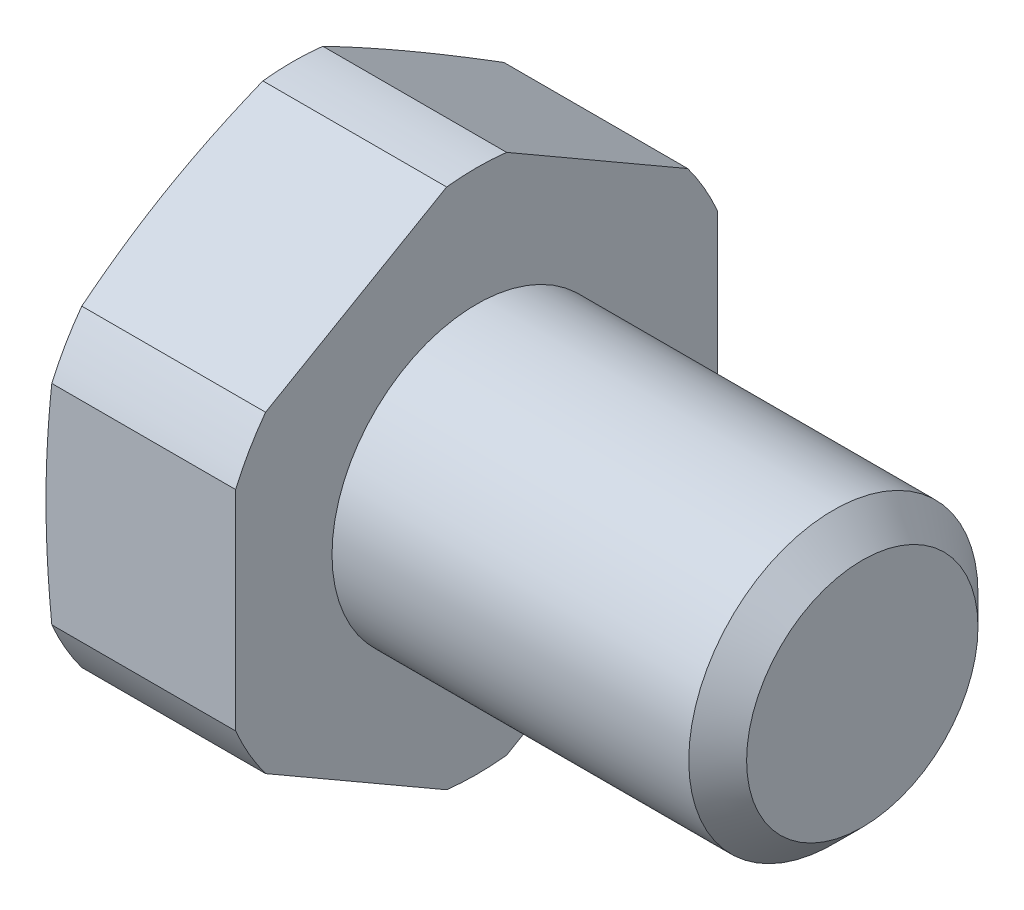
ISO-10303-21;
HEADER;
FILE_DESCRIPTION(('STEP AP214'),'2;1');
FILE_NAME('part.step','',(''),(''),'','','');
FILE_SCHEMA(('AUTOMOTIVE_DESIGN { 1 0 10303 214 1 1 1 1 }'));
ENDSEC;
DATA;
#1=APPLICATION_CONTEXT('core data for automotive mechanical design processes');
#2=APPLICATION_PROTOCOL_DEFINITION('international standard','automotive_design',2000,#1);
#3=PRODUCT_CONTEXT('',#1,'mechanical');
#4=PRODUCT('Part','Part','',(#3));
#5=PRODUCT_RELATED_PRODUCT_CATEGORY('part','',(#4));
#6=PRODUCT_DEFINITION_FORMATION('','',#4);
#7=PRODUCT_DEFINITION_CONTEXT('part definition',#1,'design');
#8=PRODUCT_DEFINITION('design','',#6,#7);
#9=PRODUCT_DEFINITION_SHAPE('','',#8);
#10=(LENGTH_UNIT() NAMED_UNIT(*) SI_UNIT(.MILLI.,.METRE.));
#11=(NAMED_UNIT(*) PLANE_ANGLE_UNIT() SI_UNIT($,.RADIAN.));
#12=(NAMED_UNIT(*) SI_UNIT($,.STERADIAN.) SOLID_ANGLE_UNIT());
#13=UNCERTAINTY_MEASURE_WITH_UNIT(LENGTH_MEASURE(1.E-05),#10,'distance_accuracy_value','');
#14=(GEOMETRIC_REPRESENTATION_CONTEXT(3) GLOBAL_UNCERTAINTY_ASSIGNED_CONTEXT((#13)) GLOBAL_UNIT_ASSIGNED_CONTEXT((#10,
#11,#12)) REPRESENTATION_CONTEXT('',''));
#15=CARTESIAN_POINT('',(0.,0.,0.));
#16=DIRECTION('',(0.,0.,1.));
#17=DIRECTION('',(1.,0.,0.));
#18=AXIS2_PLACEMENT_3D('',#15,#16,#17);
#19=CARTESIAN_POINT('',(-3.8124355652982,0.,0.));
#20=DIRECTION('',(1.,0.,0.));
#21=DIRECTION('',(0.,0.,-1.));
#22=AXIS2_PLACEMENT_3D('',#19,#20,#21);
#23=CONICAL_SURFACE('',#22,5.45,1.30899693899572);
#24=CARTESIAN_POINT('',(-4.,0.,0.));
#25=DIRECTION('',(-1.,0.,0.));
#26=DIRECTION('',(0.,0.,1.));
#27=AXIS2_PLACEMENT_3D('',#24,#25,#26);
#28=CIRCLE('',#27,4.75);
#29=CARTESIAN_POINT('',(-4.,0.,4.75));
#30=VERTEX_POINT('',#29);
#31=EDGE_CURVE('E136',#30,#30,#28,.T.);
#32=ORIENTED_EDGE('',*,*,#31,.F.);
#33=EDGE_LOOP('',(#32));
#34=FACE_BOUND('',#33,.T.);
#35=CARTESIAN_POINT('',(-3.8122355652982,3.24492698806514,-4.37962158981973));
#36=CARTESIAN_POINT('',(-3.8315035909995,3.33515905805744,-4.22333506012097));
#37=CARTESIAN_POINT('',(-3.84874992340172,3.42550504054802,-4.06685122818755));
#38=CARTESIAN_POINT('',(-3.87876035394968,3.60639535151776,-3.75354001899102));
#39=CARTESIAN_POINT('',(-3.89152379526239,3.69693970710853,-3.59671259476924));
#40=CARTESIAN_POINT('',(-3.91209179943862,3.87789023602862,-3.28329708502316));
#41=CARTESIAN_POINT('',(-3.91991159522667,3.96829596905989,-3.1267097621175));
#42=CARTESIAN_POINT('',(-3.93037186796461,4.14917681117599,-2.81341495345658));
#43=CARTESIAN_POINT('',(-3.93301270189222,4.2396519150491,-2.65670747672828));
#44=CARTESIAN_POINT('',(-3.93301270189222,4.42060212279532,-2.34329252327168));
#45=CARTESIAN_POINT('',(-3.93037186796461,4.51107722666843,-2.18658504654338));
#46=CARTESIAN_POINT('',(-3.91991159522667,4.69195806878452,-1.87329023788246));
#47=CARTESIAN_POINT('',(-3.91209179943862,4.78236380181579,-1.71670291497679));
#48=CARTESIAN_POINT('',(-3.89152379526239,4.96331433073589,-1.40328740523072));
#49=CARTESIAN_POINT('',(-3.87876035394968,5.05385868632665,-1.24645998100894));
#50=CARTESIAN_POINT('',(-3.84874992340171,5.2347489972964,-0.933148771812404));
#51=CARTESIAN_POINT('',(-3.83150359099949,5.32509497978698,-0.77666493987899));
#52=CARTESIAN_POINT('',(-3.81223556529819,5.41532704977928,-0.620378410180224));
#53=B_SPLINE_CURVE_WITH_KNOTS('',3,(#35,#36,#37,#38,#39,#40,#41,#42,#43,#44,#45,#46,#47,#48,#49,
#50,#51,#52),.UNSPECIFIED.,.F.,.F.,(4,2,2,2,2,2,2,2,4),(0.,0.54447599676277,1.08903173688009,
1.63190124482929,2.17473333231911,2.71756541980894,3.26043492775814,3.80499066787546,
4.34946666463823),.UNSPECIFIED.);
#54=CARTESIAN_POINT('',(-3.8124355652982,3.24586459681213,-4.37799760383233));
#55=VERTEX_POINT('',#54);
#56=CARTESIAN_POINT('',(-3.8124355652982,5.41438944103226,-0.622002396167665));
#57=VERTEX_POINT('',#56);
#58=EDGE_CURVE('E208',#55,#57,#53,.T.);
#59=ORIENTED_EDGE('',*,*,#58,.F.);
#60=CARTESIAN_POINT('',(-3.8124355652982,0.,0.));
#61=DIRECTION('',(-1.,0.,0.));
#62=DIRECTION('',(0.,0.,1.));
#63=AXIS2_PLACEMENT_3D('',#60,#61,#62);
#64=CIRCLE('',#63,5.45);
#65=CARTESIAN_POINT('',(-3.8124355652982,2.16852484422014,-5.));
#66=VERTEX_POINT('',#65);
#67=EDGE_CURVE('E291',#55,#66,#64,.T.);
#68=ORIENTED_EDGE('',*,*,#67,.T.);
#69=CARTESIAN_POINT('',(-2.830435154416,-7.62108614568718,-5.));
#70=CARTESIAN_POINT('',(-2.88120209797258,-7.39442371211339,-5.));
#71=CARTESIAN_POINT('',(-2.93134556516227,-7.16761907889241,-5.));
#72=CARTESIAN_POINT('',(-3.03004902948035,-6.71365560990672,-5.));
#73=CARTESIAN_POINT('',(-3.07860895773894,-6.4864967591857,-5.));
#74=CARTESIAN_POINT('',(-3.17385150931226,-6.0315495025437,-5.));
#75=CARTESIAN_POINT('',(-3.22053222527809,-5.80376069589011,-5.));
#76=CARTESIAN_POINT('',(-3.31151001956537,-5.34770783172051,-5.));
#77=CARTESIAN_POINT('',(-3.3558071181691,-5.11944377826557,-5.));
#78=CARTESIAN_POINT('',(-3.4411075281363,-4.66418646959809,-5.));
#79=CARTESIAN_POINT('',(-3.48213433474762,-4.43719763845752,-5.));
#80=CARTESIAN_POINT('',(-3.5605891401129,-3.98259997066756,-5.));
#81=CARTESIAN_POINT('',(-3.59801721846509,-3.75499114784598,-5.));
#82=CARTESIAN_POINT('',(-3.66842860196543,-3.29911107812409,-5.));
#83=CARTESIAN_POINT('',(-3.70141247969032,-3.07083992043547,-5.));
#84=CARTESIAN_POINT('',(-3.76196068204273,-2.6135717262178,-5.));
#85=CARTESIAN_POINT('',(-3.78952500224215,-2.38457468909583,-5.));
#86=CARTESIAN_POINT('',(-3.83845030974012,-1.92327707694903,-5.));
#87=CARTESIAN_POINT('',(-3.85973725345162,-1.69096853031645,-5.));
#88=CARTESIAN_POINT('',(-3.89463720444701,-1.22577076482486,-5.));
#89=CARTESIAN_POINT('',(-3.90825038771012,-0.992881559404886,-5.));
#90=CARTESIAN_POINT('',(-3.92700868255058,-0.526860013398153,-5.));
#91=CARTESIAN_POINT('',(-3.93215759017723,-0.293727828749546,-5.));
#92=CARTESIAN_POINT('',(-3.93367114199559,0.172565509188208,-5.));
#93=CARTESIAN_POINT('',(-3.93003579094568,0.405726662461594,-5.));
#94=CARTESIAN_POINT('',(-3.91418522340838,0.872602182612577,-5.));
#95=CARTESIAN_POINT('',(-3.9019387776737,1.10631546764105,-5.));
#96=CARTESIAN_POINT('',(-3.8695634215591,1.57319035782345,-5.));
#97=CARTESIAN_POINT('',(-3.84943433779392,1.80635195072895,-5.));
#98=CARTESIAN_POINT('',(-3.80230675741258,2.27212210256566,-5.));
#99=CARTESIAN_POINT('',(-3.77530380767398,2.50473020395076,-5.));
#100=CARTESIAN_POINT('',(-3.71554697344907,2.96919829473803,-5.));
#101=CARTESIAN_POINT('',(-3.68279307135858,3.20105828184795,-5.));
#102=CARTESIAN_POINT('',(-3.61492582370549,3.64858107787179,-5.));
#103=CARTESIAN_POINT('',(-3.58011659874086,3.86429046615707,-5.));
#104=CARTESIAN_POINT('',(-3.50712924185992,4.29514088007846,-5.));
#105=CARTESIAN_POINT('',(-3.46895101875147,4.51028189016726,-5.));
#106=CARTESIAN_POINT('',(-3.35031434414398,5.15498464345157,-5.));
#107=CARTESIAN_POINT('',(-3.26575944676272,5.58379089346186,-5.));
#108=CARTESIAN_POINT('',(-3.08936194162874,6.43998322963982,-5.));
#109=CARTESIAN_POINT('',(-2.99751759102386,6.86736895056687,-5.));
#110=CARTESIAN_POINT('',(-2.80885188867207,7.72100969351695,-5.));
#111=CARTESIAN_POINT('',(-2.71203082575452,8.14726477965121,-5.));
#112=CARTESIAN_POINT('',(-2.51586740601024,8.9947544783887,-5.));
#113=CARTESIAN_POINT('',(-2.41655941078843,9.41599708456601,-5.));
#114=CARTESIAN_POINT('',(-2.21545799548836,10.2578953303561,-5.));
#115=CARTESIAN_POINT('',(-2.11366453046326,10.6785509592085,-5.));
#116=CARTESIAN_POINT('',(-1.90836724186912,11.5188975285423,-5.));
#117=CARTESIAN_POINT('',(-1.80486566651573,11.9385890195114,-5.));
#118=CARTESIAN_POINT('',(-1.59644919766966,12.7776065494314,-5.));
#119=CARTESIAN_POINT('',(-1.49153435068999,13.1969325999283,-5.));
#120=CARTESIAN_POINT('',(-1.38611863930613,13.6161312291119,-5.));
#121=B_SPLINE_CURVE_WITH_KNOTS('',3,(#69,#70,#71,#72,#73,#74,#75,#76,#77,#78,#79,#80,#81,#82,
#83,#84,#85,#86,#87,#88,#89,#90,#91,#92,#93,#94,#95,#96,#97,#98,#99,#100,#101,#102,#103,#104,
#105,#106,#107,#108,#109,#110,#111,#112,#113,#114,#115,#116,#117,#118,#119,#120),.UNSPECIFIED.,
.F.,.F.,(4,2,2,2,2,2,2,2,2,2,2,2,2,2,2,2,2,2,2,2,2,2,2,2,2,4),(0.,0.696837321487225,
1.39370490886476,2.09126282716078,2.78881480897114,3.48079178070997,4.17275344348079,
4.86462587068375,5.5564988631845,6.25623321055747,6.95595151055346,7.65535591593532,
8.3547599424542,9.05671361858794,9.75868273565141,10.4611077745029,11.1635349635777,
11.8190031071993,12.4744889984981,13.785567701482,15.0969608231136,16.4082779222481,
17.7066391814984,19.0050239375285,20.3018179916293,21.5985694699626),.UNSPECIFIED.);
#122=CARTESIAN_POINT('',(-3.8124355652982,-2.16852484422014,-5.));
#123=VERTEX_POINT('',#122);
#124=EDGE_CURVE('E187',#123,#66,#121,.T.);
#125=ORIENTED_EDGE('',*,*,#124,.F.);
#126=CARTESIAN_POINT('',(-3.8124355652982,-3.24586459681212,-4.37799760383234));
#127=VERTEX_POINT('',#126);
#128=EDGE_CURVE('E186',#123,#127,#64,.T.);
#129=ORIENTED_EDGE('',*,*,#128,.T.);
#130=CARTESIAN_POINT('',(-3.81223556529819,-5.41532704977928,-0.620378410180221));
#131=CARTESIAN_POINT('',(-3.83150359099949,-5.32509497978698,-0.776664939878987));
#132=CARTESIAN_POINT('',(-3.84874992340172,-5.2347489972964,-0.933148771812401));
#133=CARTESIAN_POINT('',(-3.87876035394968,-5.05385868632665,-1.24645998100894));
#134=CARTESIAN_POINT('',(-3.89152379526239,-4.96331433073589,-1.40328740523072));
#135=CARTESIAN_POINT('',(-3.91209179943862,-4.78236380181579,-1.71670291497679));
#136=CARTESIAN_POINT('',(-3.91991159522667,-4.69195806878452,-1.87329023788246));
#137=CARTESIAN_POINT('',(-3.93037186796461,-4.51107722666843,-2.18658504654338));
#138=CARTESIAN_POINT('',(-3.93301270189222,-4.42060212279532,-2.34329252327168));
#139=CARTESIAN_POINT('',(-3.93301270189222,-4.23965191504909,-2.65670747672828));
#140=CARTESIAN_POINT('',(-3.93037186796461,-4.14917681117598,-2.81341495345658));
#141=CARTESIAN_POINT('',(-3.91991159522667,-3.96829596905989,-3.1267097621175));
#142=CARTESIAN_POINT('',(-3.91209179943862,-3.87789023602862,-3.28329708502316));
#143=CARTESIAN_POINT('',(-3.89152379526239,-3.69693970710852,-3.59671259476924));
#144=CARTESIAN_POINT('',(-3.87876035394968,-3.60639535151776,-3.75354001899102));
#145=CARTESIAN_POINT('',(-3.84874992340172,-3.42550504054801,-4.06685122818756));
#146=CARTESIAN_POINT('',(-3.8315035909995,-3.33515905805743,-4.22333506012097));
#147=CARTESIAN_POINT('',(-3.8122355652982,-3.24492698806514,-4.37962158981974));
#148=B_SPLINE_CURVE_WITH_KNOTS('',3,(#130,#131,#132,#133,#134,#135,#136,#137,#138,#139,#140,
#141,#142,#143,#144,#145,#146,#147),.UNSPECIFIED.,.F.,.F.,(4,2,2,2,2,2,2,2,4),(0.,
0.54447599676277,1.08903173688009,1.63190124482929,2.17473333231912,2.71756541980895,
3.26043492775815,3.80499066787546,4.34946666463824),.UNSPECIFIED.);
#149=CARTESIAN_POINT('',(-3.8124355652982,-5.41438944103226,-0.622002396167663));
#150=VERTEX_POINT('',#149);
#151=EDGE_CURVE('E273',#150,#127,#148,.T.);
#152=ORIENTED_EDGE('',*,*,#151,.F.);
#153=CARTESIAN_POINT('',(-3.8124355652982,-5.41438944103226,0.622002396167663));
#154=VERTEX_POINT('',#153);
#155=EDGE_CURVE('E293',#150,#154,#64,.T.);
#156=ORIENTED_EDGE('',*,*,#155,.T.);
#157=CARTESIAN_POINT('',(-3.8122355652982,-3.24492698806514,4.37962158981974));
#158=CARTESIAN_POINT('',(-3.8315035909995,-3.33515905805743,4.22333506012097));
#159=CARTESIAN_POINT('',(-3.84874992340172,-3.42550504054801,4.06685122818756));
#160=CARTESIAN_POINT('',(-3.87876035394968,-3.60639535151776,3.75354001899102));
#161=CARTESIAN_POINT('',(-3.89152379526239,-3.69693970710852,3.59671259476924));
#162=CARTESIAN_POINT('',(-3.91209179943862,-3.87789023602862,3.28329708502316));
#163=CARTESIAN_POINT('',(-3.91991159522667,-3.96829596905989,3.1267097621175));
#164=CARTESIAN_POINT('',(-3.93037186796461,-4.14917681117598,2.81341495345658));
#165=CARTESIAN_POINT('',(-3.93301270189222,-4.23965191504909,2.65670747672828));
#166=CARTESIAN_POINT('',(-3.93301270189222,-4.42060212279532,2.34329252327168));
#167=CARTESIAN_POINT('',(-3.93037186796461,-4.51107722666843,2.18658504654337));
#168=CARTESIAN_POINT('',(-3.91991159522667,-4.69195806878452,1.87329023788246));
#169=CARTESIAN_POINT('',(-3.91209179943862,-4.78236380181579,1.71670291497679));
#170=CARTESIAN_POINT('',(-3.89152379526239,-4.96331433073589,1.40328740523072));
#171=CARTESIAN_POINT('',(-3.87876035394968,-5.05385868632665,1.24645998100894));
#172=CARTESIAN_POINT('',(-3.84874992340172,-5.2347489972964,0.9331487718124));
#173=CARTESIAN_POINT('',(-3.83150359099949,-5.32509497978698,0.776664939878986));
#174=CARTESIAN_POINT('',(-3.81223556529819,-5.41532704977928,0.62037841018022));
#175=B_SPLINE_CURVE_WITH_KNOTS('',3,(#157,#158,#159,#160,#161,#162,#163,#164,#165,#166,#167,
#168,#169,#170,#171,#172,#173,#174),.UNSPECIFIED.,.F.,.F.,(4,2,2,2,2,2,2,2,4),(0.,
0.544475996762772,1.08903173688009,1.63190124482929,2.17473333231912,2.71756541980895,
3.26043492775815,3.80499066787547,4.34946666463824),.UNSPECIFIED.);
#176=CARTESIAN_POINT('',(-3.8124355652982,-3.24586459681212,4.37799760383234));
#177=VERTEX_POINT('',#176);
#178=EDGE_CURVE('E262',#177,#154,#175,.T.);
#179=ORIENTED_EDGE('',*,*,#178,.F.);
#180=CARTESIAN_POINT('',(-3.8124355652982,-2.16852484422015,4.99999999999999));
#181=VERTEX_POINT('',#180);
#182=EDGE_CURVE('E154',#177,#181,#64,.T.);
#183=ORIENTED_EDGE('',*,*,#182,.T.);
#184=CARTESIAN_POINT('',(-2.830435154416,-7.62108614568718,5.));
#185=CARTESIAN_POINT('',(-2.88120209797258,-7.39442371211339,5.));
#186=CARTESIAN_POINT('',(-2.93134556516227,-7.16761907889241,5.));
#187=CARTESIAN_POINT('',(-3.03004902948035,-6.71365560990671,5.));
#188=CARTESIAN_POINT('',(-3.07860895773894,-6.48649675918569,5.));
#189=CARTESIAN_POINT('',(-3.17385150931226,-6.0315495025437,5.));
#190=CARTESIAN_POINT('',(-3.22053222527809,-5.80376069589011,4.99999999999999));
#191=CARTESIAN_POINT('',(-3.31151001956537,-5.34770783172051,4.99999999999999));
#192=CARTESIAN_POINT('',(-3.3558071181691,-5.11944377826557,4.99999999999999));
#193=CARTESIAN_POINT('',(-3.4411075281363,-4.66418646959809,4.99999999999999));
#194=CARTESIAN_POINT('',(-3.48213433474763,-4.43719763845752,4.99999999999999));
#195=CARTESIAN_POINT('',(-3.56058914011291,-3.98259997066756,4.99999999999999));
#196=CARTESIAN_POINT('',(-3.59801721846509,-3.75499114784598,4.99999999999999));
#197=CARTESIAN_POINT('',(-3.66842860196544,-3.29911107812409,4.99999999999999));
#198=CARTESIAN_POINT('',(-3.70141247969033,-3.07083992043547,4.99999999999999));
#199=CARTESIAN_POINT('',(-3.76196068204273,-2.61357172621781,4.99999999999999));
#200=CARTESIAN_POINT('',(-3.78952500224215,-2.38457468909583,4.99999999999999));
#201=CARTESIAN_POINT('',(-3.83845030974012,-1.92327707694904,4.99999999999999));
#202=CARTESIAN_POINT('',(-3.85973725345163,-1.69096853031646,4.99999999999999));
#203=CARTESIAN_POINT('',(-3.89463720444701,-1.22577076482486,4.99999999999999));
#204=CARTESIAN_POINT('',(-3.90825038771012,-0.99288155940489,4.99999999999999));
#205=CARTESIAN_POINT('',(-3.92700868255058,-0.526860013398158,4.99999999999999));
#206=CARTESIAN_POINT('',(-3.93215759017723,-0.29372782874955,4.99999999999999));
#207=CARTESIAN_POINT('',(-3.9336711419956,0.172565509188203,4.99999999999999));
#208=CARTESIAN_POINT('',(-3.93003579094568,0.405726662461588,4.99999999999999));
#209=CARTESIAN_POINT('',(-3.91418522340838,0.872602182612571,4.99999999999999));
#210=CARTESIAN_POINT('',(-3.9019387776737,1.10631546764104,4.99999999999999));
#211=CARTESIAN_POINT('',(-3.8695634215591,1.57319035782344,4.99999999999999));
#212=CARTESIAN_POINT('',(-3.84943433779392,1.80635195072894,4.99999999999999));
#213=CARTESIAN_POINT('',(-3.80230675741258,2.27212210256566,4.99999999999999));
#214=CARTESIAN_POINT('',(-3.77530380767398,2.50473020395075,4.99999999999999));
#215=CARTESIAN_POINT('',(-3.71554697344907,2.96919829473802,4.99999999999999));
#216=CARTESIAN_POINT('',(-3.68279307135859,3.20105828184795,4.99999999999999));
#217=CARTESIAN_POINT('',(-3.6149258237055,3.64858107787179,4.99999999999999));
#218=CARTESIAN_POINT('',(-3.58011659874086,3.86429046615706,4.99999999999999));
#219=CARTESIAN_POINT('',(-3.50712924185992,4.29514088007846,4.99999999999999));
#220=CARTESIAN_POINT('',(-3.46895101875147,4.51028189016725,4.99999999999999));
#221=CARTESIAN_POINT('',(-3.35031434414398,5.15498464345157,4.99999999999999));
#222=CARTESIAN_POINT('',(-3.26575944676272,5.58379089346185,4.99999999999999));
#223=CARTESIAN_POINT('',(-3.08936194162874,6.43998322963981,4.99999999999999));
#224=CARTESIAN_POINT('',(-2.99751759102386,6.86736895056686,4.99999999999999));
#225=CARTESIAN_POINT('',(-2.80885188867208,7.72100969351695,4.99999999999999));
#226=CARTESIAN_POINT('',(-2.71203082575452,8.14726477965121,4.99999999999999));
#227=CARTESIAN_POINT('',(-2.51586740601024,8.9947544783887,4.99999999999999));
#228=CARTESIAN_POINT('',(-2.41655941078843,9.41599708456601,4.99999999999999));
#229=CARTESIAN_POINT('',(-2.21545799548836,10.2578953303561,4.99999999999999));
#230=CARTESIAN_POINT('',(-2.11366453046326,10.6785509592085,4.99999999999999));
#231=CARTESIAN_POINT('',(-1.90836724186913,11.5188975285423,4.99999999999999));
#232=CARTESIAN_POINT('',(-1.80486566651573,11.9385890195114,4.99999999999999));
#233=CARTESIAN_POINT('',(-1.59644919766966,12.7776065494314,4.99999999999999));
#234=CARTESIAN_POINT('',(-1.49153435068999,13.1969325999283,4.99999999999999));
#235=CARTESIAN_POINT('',(-1.38611863930613,13.6161312291119,4.99999999999999));
#236=B_SPLINE_CURVE_WITH_KNOTS('',3,(#184,#185,#186,#187,#188,#189,#190,#191,#192,#193,#194,
#195,#196,#197,#198,#199,#200,#201,#202,#203,#204,#205,#206,#207,#208,#209,#210,#211,#212,#213,
#214,#215,#216,#217,#218,#219,#220,#221,#222,#223,#224,#225,#226,#227,#228,#229,#230,#231,#232,
#233,#234,#235),.UNSPECIFIED.,.F.,.F.,(4,2,2,2,2,2,2,2,2,2,2,2,2,2,2,2,2,2,2,2,2,2,2,2,2,4),(0.,
0.696837321487224,1.39370490886476,2.09126282716078,2.78881480897114,3.48079178070997,
4.17275344348078,4.86462587068374,5.55649886318449,6.25623321055747,6.95595151055345,
7.65535591593531,8.35475994245419,9.05671361858793,9.7586827356514,10.4611077745029,
11.1635349635777,11.8190031071993,12.4744889984981,13.785567701482,15.0969608231136,
16.4082779222481,17.7066391814984,19.0050239375285,20.3018179916293,21.5985694699626),.UNSPECIFIED.);
#237=CARTESIAN_POINT('',(-3.8124355652982,2.16852484422016,4.99999999999999));
#238=VERTEX_POINT('',#237);
#239=EDGE_CURVE('E245',#238,#181,#236,.F.);
#240=ORIENTED_EDGE('',*,*,#239,.F.);
#241=CARTESIAN_POINT('',(-3.8124355652982,3.24586459681212,4.37799760383234));
#242=VERTEX_POINT('',#241);
#243=EDGE_CURVE('E162',#238,#242,#64,.T.);
#244=ORIENTED_EDGE('',*,*,#243,.T.);
#245=CARTESIAN_POINT('',(-3.81223556529819,5.41532704977928,0.620378410180223));
#246=CARTESIAN_POINT('',(-3.83150359099949,5.32509497978698,0.77666493987899));
#247=CARTESIAN_POINT('',(-3.84874992340171,5.2347489972964,0.933148771812404));
#248=CARTESIAN_POINT('',(-3.87876035394968,5.05385868632665,1.24645998100894));
#249=CARTESIAN_POINT('',(-3.89152379526239,4.96331433073589,1.40328740523072));
#250=CARTESIAN_POINT('',(-3.91209179943862,4.78236380181579,1.71670291497679));
#251=CARTESIAN_POINT('',(-3.91991159522667,4.69195806878452,1.87329023788246));
#252=CARTESIAN_POINT('',(-3.93037186796461,4.51107722666843,2.18658504654338));
#253=CARTESIAN_POINT('',(-3.93301270189222,4.42060212279532,2.34329252327168));
#254=CARTESIAN_POINT('',(-3.93301270189222,4.2396519150491,2.65670747672828));
#255=CARTESIAN_POINT('',(-3.93037186796461,4.14917681117598,2.81341495345658));
#256=CARTESIAN_POINT('',(-3.91991159522667,3.96829596905989,3.1267097621175));
#257=CARTESIAN_POINT('',(-3.91209179943862,3.87789023602862,3.28329708502316));
#258=CARTESIAN_POINT('',(-3.89152379526239,3.69693970710852,3.59671259476924));
#259=CARTESIAN_POINT('',(-3.87876035394968,3.60639535151776,3.75354001899102));
#260=CARTESIAN_POINT('',(-3.84874992340172,3.42550504054801,4.06685122818755));
#261=CARTESIAN_POINT('',(-3.8315035909995,3.33515905805743,4.22333506012097));
#262=CARTESIAN_POINT('',(-3.8122355652982,3.24492698806514,4.37962158981974));
#263=B_SPLINE_CURVE_WITH_KNOTS('',3,(#245,#246,#247,#248,#249,#250,#251,#252,#253,#254,#255,
#256,#257,#258,#259,#260,#261,#262),.UNSPECIFIED.,.F.,.F.,(4,2,2,2,2,2,2,2,4),(0.,
0.54447599676277,1.08903173688009,1.63190124482929,2.17473333231912,2.71756541980894,
3.26043492775814,3.80499066787546,4.34946666463823),.UNSPECIFIED.);
#264=CARTESIAN_POINT('',(-3.8124355652982,5.41438944103226,0.622002396167664));
#265=VERTEX_POINT('',#264);
#266=EDGE_CURVE('E146',#265,#242,#263,.T.);
#267=ORIENTED_EDGE('',*,*,#266,.F.);
#268=EDGE_CURVE('E145',#265,#57,#64,.T.);
#269=ORIENTED_EDGE('',*,*,#268,.T.);
#270=EDGE_LOOP('',(#59,#68,#125,#129,#152,#156,#179,#183,#240,#244,#267,#269));
#271=FACE_BOUND('',#270,.T.);
#272=ADVANCED_FACE('F37',(#34,#271),#23,.T.);
#273=CARTESIAN_POINT('',(-1000.,0.,0.));
#274=DIRECTION('',(-1.,0.,0.));
#275=DIRECTION('',(0.,0.,1.));
#276=AXIS2_PLACEMENT_3D('',#273,#274,#275);
#277=CYLINDRICAL_SURFACE('',#276,5.45);
#278=DIRECTION('',(-1.,0.,0.));
#279=VECTOR('',#278,1.);
#280=CARTESIAN_POINT('',(-1000.,3.24586459681213,-4.37799760383233));
#281=LINE('',#280,#279);
#282=CARTESIAN_POINT('',(0.,3.24586459681213,-4.37799760383233));
#283=VERTEX_POINT('',#282);
#284=EDGE_CURVE('E217',#283,#55,#281,.T.);
#285=ORIENTED_EDGE('',*,*,#284,.F.);
#286=CARTESIAN_POINT('',(0.,0.,0.));
#287=DIRECTION('',(-1.,0.,0.));
#288=DIRECTION('',(0.,0.,1.));
#289=AXIS2_PLACEMENT_3D('',#286,#287,#288);
#290=CIRCLE('',#289,5.45);
#291=CARTESIAN_POINT('',(0.,2.16852484422014,-5.));
#292=VERTEX_POINT('',#291);
#293=EDGE_CURVE('E152',#283,#292,#290,.T.);
#294=ORIENTED_EDGE('',*,*,#293,.T.);
#295=DIRECTION('',(-1.,0.,0.));
#296=VECTOR('',#295,1.);
#297=CARTESIAN_POINT('',(-1000.,2.16852484422014,-5.));
#298=LINE('',#297,#296);
#299=EDGE_CURVE('E178',#66,#292,#298,.F.);
#300=ORIENTED_EDGE('',*,*,#299,.F.);
#301=ORIENTED_EDGE('',*,*,#67,.F.);
#302=EDGE_LOOP('',(#285,#294,#300,#301));
#303=FACE_BOUND('',#302,.T.);
#304=ADVANCED_FACE('F292',(#303),#277,.T.);
#305=DIRECTION('',(-1.,0.,0.));
#306=VECTOR('',#305,1.);
#307=CARTESIAN_POINT('',(-1000.,5.41438944103226,-0.622002396167665));
#308=LINE('',#307,#306);
#309=CARTESIAN_POINT('',(0.,5.41438944103226,-0.62200239616767));
#310=VERTEX_POINT('',#309);
#311=EDGE_CURVE('E284',#57,#310,#308,.F.);
#312=ORIENTED_EDGE('',*,*,#311,.F.);
#313=ORIENTED_EDGE('',*,*,#268,.F.);
#314=DIRECTION('',(-1.,0.,0.));
#315=VECTOR('',#314,1.);
#316=CARTESIAN_POINT('',(-1000.,5.41438944103226,0.622002396167664));
#317=LINE('',#316,#315);
#318=CARTESIAN_POINT('',(0.,5.41438944103226,0.622002396167668));
#319=VERTEX_POINT('',#318);
#320=EDGE_CURVE('E127',#319,#265,#317,.T.);
#321=ORIENTED_EDGE('',*,*,#320,.F.);
#322=EDGE_CURVE('E143',#319,#310,#290,.T.);
#323=ORIENTED_EDGE('',*,*,#322,.T.);
#324=EDGE_LOOP('',(#312,#313,#321,#323));
#325=FACE_BOUND('',#324,.T.);
#326=ADVANCED_FACE('F142',(#325),#277,.T.);
#327=DIRECTION('',(-1.,0.,0.));
#328=VECTOR('',#327,1.);
#329=CARTESIAN_POINT('',(-1000.,-2.16852484422014,-5.));
#330=LINE('',#329,#328);
#331=CARTESIAN_POINT('',(0.,-2.16852484422014,-5.));
#332=VERTEX_POINT('',#331);
#333=EDGE_CURVE('E175',#332,#123,#330,.T.);
#334=ORIENTED_EDGE('',*,*,#333,.F.);
#335=CARTESIAN_POINT('',(0.,-3.24586459681213,-4.37799760383234));
#336=VERTEX_POINT('',#335);
#337=EDGE_CURVE('E157',#332,#336,#290,.T.);
#338=ORIENTED_EDGE('',*,*,#337,.T.);
#339=DIRECTION('',(-1.,0.,0.));
#340=VECTOR('',#339,1.);
#341=CARTESIAN_POINT('',(-1000.,-3.24586459681212,-4.37799760383234));
#342=LINE('',#341,#340);
#343=EDGE_CURVE('E268',#127,#336,#342,.F.);
#344=ORIENTED_EDGE('',*,*,#343,.F.);
#345=ORIENTED_EDGE('',*,*,#128,.F.);
#346=EDGE_LOOP('',(#334,#338,#344,#345));
#347=FACE_BOUND('',#346,.T.);
#348=ADVANCED_FACE('F183',(#347),#277,.T.);
#349=DIRECTION('',(-1.,0.,0.));
#350=VECTOR('',#349,1.);
#351=CARTESIAN_POINT('',(-1000.,-5.41438944103226,-0.622002396167663));
#352=LINE('',#351,#350);
#353=CARTESIAN_POINT('',(0.,-5.41438944103227,-0.622002396167667));
#354=VERTEX_POINT('',#353);
#355=EDGE_CURVE('E271',#354,#150,#352,.T.);
#356=ORIENTED_EDGE('',*,*,#355,.F.);
#357=CARTESIAN_POINT('',(0.,-5.41438944103226,0.62200239616767));
#358=VERTEX_POINT('',#357);
#359=EDGE_CURVE('E191',#354,#358,#290,.T.);
#360=ORIENTED_EDGE('',*,*,#359,.T.);
#361=DIRECTION('',(-1.,0.,0.));
#362=VECTOR('',#361,1.);
#363=CARTESIAN_POINT('',(-1000.,-5.41438944103226,0.622002396167663));
#364=LINE('',#363,#362);
#365=EDGE_CURVE('E60',#154,#358,#364,.F.);
#366=ORIENTED_EDGE('',*,*,#365,.F.);
#367=ORIENTED_EDGE('',*,*,#155,.F.);
#368=EDGE_LOOP('',(#356,#360,#366,#367));
#369=FACE_BOUND('',#368,.T.);
#370=ADVANCED_FACE('F312',(#369),#277,.T.);
#371=DIRECTION('',(-1.,0.,0.));
#372=VECTOR('',#371,1.);
#373=CARTESIAN_POINT('',(-1000.,-3.24586459681212,4.37799760383234));
#374=LINE('',#373,#372);
#375=CARTESIAN_POINT('',(0.,-3.24586459681213,4.37799760383233));
#376=VERTEX_POINT('',#375);
#377=EDGE_CURVE('E269',#376,#177,#374,.T.);
#378=ORIENTED_EDGE('',*,*,#377,.F.);
#379=CARTESIAN_POINT('',(0.,-2.16852484422015,4.99999999999999));
#380=VERTEX_POINT('',#379);
#381=EDGE_CURVE('E155',#376,#380,#290,.T.);
#382=ORIENTED_EDGE('',*,*,#381,.T.);
#383=DIRECTION('',(-1.,0.,0.));
#384=VECTOR('',#383,1.);
#385=CARTESIAN_POINT('',(-1000.,-2.16852484422015,4.99999999999999));
#386=LINE('',#385,#384);
#387=EDGE_CURVE('E52',#181,#380,#386,.F.);
#388=ORIENTED_EDGE('',*,*,#387,.F.);
#389=ORIENTED_EDGE('',*,*,#182,.F.);
#390=EDGE_LOOP('',(#378,#382,#388,#389));
#391=FACE_BOUND('',#390,.T.);
#392=ADVANCED_FACE('F302',(#391),#277,.T.);
#393=DIRECTION('',(-1.,0.,0.));
#394=VECTOR('',#393,1.);
#395=CARTESIAN_POINT('',(-1000.,2.16852484422016,4.99999999999999));
#396=LINE('',#395,#394);
#397=CARTESIAN_POINT('',(0.,2.16852484422016,4.99999999999999));
#398=VERTEX_POINT('',#397);
#399=EDGE_CURVE('E243',#398,#238,#396,.T.);
#400=ORIENTED_EDGE('',*,*,#399,.F.);
#401=CARTESIAN_POINT('',(0.,3.24586459681213,4.37799760383233));
#402=VERTEX_POINT('',#401);
#403=EDGE_CURVE('E151',#398,#402,#290,.T.);
#404=ORIENTED_EDGE('',*,*,#403,.T.);
#405=DIRECTION('',(-1.,0.,0.));
#406=VECTOR('',#405,1.);
#407=CARTESIAN_POINT('',(-1000.,3.24586459681212,4.37799760383234));
#408=LINE('',#407,#406);
#409=EDGE_CURVE('E130',#242,#402,#408,.F.);
#410=ORIENTED_EDGE('',*,*,#409,.F.);
#411=ORIENTED_EDGE('',*,*,#243,.F.);
#412=EDGE_LOOP('',(#400,#404,#410,#411));
#413=FACE_BOUND('',#412,.T.);
#414=ADVANCED_FACE('F305',(#413),#277,.T.);
#415=CARTESIAN_POINT('',(0.,5.45,0.));
#416=DIRECTION('',(-1.,0.,0.));
#417=DIRECTION('',(0.,0.,1.));
#418=AXIS2_PLACEMENT_3D('',#415,#416,#417);
#419=PLANE('',#418);
#420=CARTESIAN_POINT('',(0.,0.,0.));
#421=DIRECTION('',(-1.,0.,0.));
#422=DIRECTION('',(0.,0.,1.));
#423=AXIS2_PLACEMENT_3D('',#420,#421,#422);
#424=CIRCLE('',#423,3.);
#425=CARTESIAN_POINT('',(0.,0.,3.));
#426=VERTEX_POINT('',#425);
#427=EDGE_CURVE('E160',#426,#426,#424,.T.);
#428=ORIENTED_EDGE('',*,*,#427,.T.);
#429=EDGE_LOOP('',(#428));
#430=FACE_BOUND('',#429,.T.);
#431=DIRECTION('',(0.,-0.5,-0.866025403784439));
#432=VECTOR('',#431,1.);
#433=CARTESIAN_POINT('',(0.,5.6926270189222,-0.140080774687406));
#434=LINE('',#433,#432);
#435=EDGE_CURVE('E12',#310,#283,#434,.T.);
#436=ORIENTED_EDGE('',*,*,#435,.F.);
#437=ORIENTED_EDGE('',*,*,#322,.F.);
#438=DIRECTION('',(0.,0.5,-0.866025403784439));
#439=VECTOR('',#438,1.);
#440=CARTESIAN_POINT('',(0.,5.6926270189222,0.140080774687406));
#441=LINE('',#440,#439);
#442=EDGE_CURVE('E124',#402,#319,#441,.T.);
#443=ORIENTED_EDGE('',*,*,#442,.F.);
#444=ORIENTED_EDGE('',*,*,#403,.F.);
#445=DIRECTION('',(0.,1.,0.));
#446=VECTOR('',#445,1.);
#447=CARTESIAN_POINT('',(0.,5.45,4.99999999999999));
#448=LINE('',#447,#446);
#449=EDGE_CURVE('E135',#380,#398,#448,.T.);
#450=ORIENTED_EDGE('',*,*,#449,.F.);
#451=ORIENTED_EDGE('',*,*,#381,.F.);
#452=DIRECTION('',(0.,0.5,0.866025403784439));
#453=VECTOR('',#452,1.);
#454=CARTESIAN_POINT('',(0.,-2.9676270189222,4.8599192253126));
#455=LINE('',#454,#453);
#456=EDGE_CURVE('E168',#358,#376,#455,.T.);
#457=ORIENTED_EDGE('',*,*,#456,.F.);
#458=ORIENTED_EDGE('',*,*,#359,.F.);
#459=DIRECTION('',(0.,-0.5,0.866025403784439));
#460=VECTOR('',#459,1.);
#461=CARTESIAN_POINT('',(0.,-2.96762701892219,-4.8599192253126));
#462=LINE('',#461,#460);
#463=EDGE_CURVE('E170',#336,#354,#462,.T.);
#464=ORIENTED_EDGE('',*,*,#463,.F.);
#465=ORIENTED_EDGE('',*,*,#337,.F.);
#466=DIRECTION('',(0.,-1.,0.));
#467=VECTOR('',#466,1.);
#468=CARTESIAN_POINT('',(0.,5.45,-5.));
#469=LINE('',#468,#467);
#470=EDGE_CURVE('E45',#292,#332,#469,.T.);
#471=ORIENTED_EDGE('',*,*,#470,.F.);
#472=ORIENTED_EDGE('',*,*,#293,.F.);
#473=EDGE_LOOP('',(#436,#437,#443,#444,#450,#451,#457,#458,#464,#465,#471,#472));
#474=FACE_BOUND('',#473,.T.);
#475=ADVANCED_FACE('F149',(#430,#474),#419,.F.);
#476=CARTESIAN_POINT('',(-4.,0.,0.));
#477=DIRECTION('',(1.,0.,0.));
#478=DIRECTION('',(0.,0.,-1.));
#479=AXIS2_PLACEMENT_3D('',#476,#477,#478);
#480=PLANE('',#479);
#481=ORIENTED_EDGE('',*,*,#31,.T.);
#482=EDGE_LOOP('',(#481));
#483=FACE_BOUND('',#482,.T.);
#484=ADVANCED_FACE('F39',(#483),#480,.F.);
#485=CARTESIAN_POINT('',(-1000.,0.,0.));
#486=DIRECTION('',(-1.,0.,0.));
#487=DIRECTION('',(0.,0.,1.));
#488=AXIS2_PLACEMENT_3D('',#485,#486,#487);
#489=CYLINDRICAL_SURFACE('',#488,3.);
#490=ORIENTED_EDGE('',*,*,#427,.F.);
#491=EDGE_LOOP('',(#490));
#492=FACE_BOUND('',#491,.T.);
#493=CARTESIAN_POINT('',(7.40000000000007,0.,0.));
#494=DIRECTION('',(-1.,0.,0.));
#495=DIRECTION('',(0.,0.,1.));
#496=AXIS2_PLACEMENT_3D('',#493,#494,#495);
#497=CIRCLE('',#496,3.);
#498=CARTESIAN_POINT('',(7.40000000000007,0.,3.));
#499=VERTEX_POINT('',#498);
#500=EDGE_CURVE('E200',#499,#499,#497,.T.);
#501=ORIENTED_EDGE('',*,*,#500,.T.);
#502=EDGE_LOOP('',(#501));
#503=FACE_BOUND('',#502,.T.);
#504=ADVANCED_FACE('F321',(#492,#503),#489,.T.);
#505=CARTESIAN_POINT('',(8.00000000000001,0.,0.));
#506=DIRECTION('',(-1.,0.,0.));
#507=DIRECTION('',(0.,0.,1.));
#508=AXIS2_PLACEMENT_3D('',#505,#506,#507);
#509=CONICAL_SURFACE('',#508,2.4,0.785398163397503);
#510=ORIENTED_EDGE('',*,*,#500,.F.);
#511=EDGE_LOOP('',(#510));
#512=FACE_BOUND('',#511,.T.);
#513=CARTESIAN_POINT('',(8.00000000000001,0.,0.));
#514=DIRECTION('',(-1.,0.,0.));
#515=DIRECTION('',(0.,0.,1.));
#516=AXIS2_PLACEMENT_3D('',#513,#514,#515);
#517=CIRCLE('',#516,2.4);
#518=CARTESIAN_POINT('',(8.00000000000001,0.,2.4));
#519=VERTEX_POINT('',#518);
#520=EDGE_CURVE('E204',#519,#519,#517,.T.);
#521=ORIENTED_EDGE('',*,*,#520,.T.);
#522=EDGE_LOOP('',(#521));
#523=FACE_BOUND('',#522,.T.);
#524=ADVANCED_FACE('F325',(#512,#523),#509,.T.);
#525=CARTESIAN_POINT('',(8.,2.4,0.));
#526=DIRECTION('',(-1.,0.,0.));
#527=DIRECTION('',(0.,0.,1.));
#528=AXIS2_PLACEMENT_3D('',#525,#526,#527);
#529=PLANE('',#528);
#530=ORIENTED_EDGE('',*,*,#520,.F.);
#531=EDGE_LOOP('',(#530));
#532=FACE_BOUND('',#531,.T.);
#533=ADVANCED_FACE('F233',(#532),#529,.F.);
#534=CARTESIAN_POINT('',(24.037812018269,2.88675134594813,4.99999999999999));
#535=DIRECTION('',(0.,0.866025403784438,0.5));
#536=DIRECTION('',(0.,-0.5,0.866025403784439));
#537=AXIS2_PLACEMENT_3D('',#534,#535,#536);
#538=PLANE('',#537);
#539=ORIENTED_EDGE('',*,*,#266,.T.);
#540=ORIENTED_EDGE('',*,*,#409,.T.);
#541=ORIENTED_EDGE('',*,*,#442,.T.);
#542=ORIENTED_EDGE('',*,*,#320,.T.);
#543=EDGE_LOOP('',(#539,#540,#541,#542));
#544=FACE_BOUND('',#543,.T.);
#545=ADVANCED_FACE('F126',(#544),#538,.T.);
#546=CARTESIAN_POINT('',(24.037812018269,-2.88675134594813,4.99999999999999));
#547=DIRECTION('',(0.,0.,1.));
#548=DIRECTION('',(0.,-1.,0.));
#549=AXIS2_PLACEMENT_3D('',#546,#547,#548);
#550=PLANE('',#549);
#551=ORIENTED_EDGE('',*,*,#239,.T.);
#552=ORIENTED_EDGE('',*,*,#387,.T.);
#553=ORIENTED_EDGE('',*,*,#449,.T.);
#554=ORIENTED_EDGE('',*,*,#399,.T.);
#555=EDGE_LOOP('',(#551,#552,#553,#554));
#556=FACE_BOUND('',#555,.T.);
#557=ADVANCED_FACE('F232',(#556),#550,.T.);
#558=CARTESIAN_POINT('',(24.037812018269,-5.77350269189626,0.));
#559=DIRECTION('',(0.,-0.866025403784439,0.5));
#560=DIRECTION('',(0.,-0.5,-0.866025403784439));
#561=AXIS2_PLACEMENT_3D('',#558,#559,#560);
#562=PLANE('',#561);
#563=ORIENTED_EDGE('',*,*,#178,.T.);
#564=ORIENTED_EDGE('',*,*,#365,.T.);
#565=ORIENTED_EDGE('',*,*,#456,.T.);
#566=ORIENTED_EDGE('',*,*,#377,.T.);
#567=EDGE_LOOP('',(#563,#564,#565,#566));
#568=FACE_BOUND('',#567,.T.);
#569=ADVANCED_FACE('F256',(#568),#562,.T.);
#570=CARTESIAN_POINT('',(24.037812018269,-2.88675134594813,-5.));
#571=DIRECTION('',(0.,-0.866025403784439,-0.5));
#572=DIRECTION('',(0.,0.5,-0.866025403784439));
#573=AXIS2_PLACEMENT_3D('',#570,#571,#572);
#574=PLANE('',#573);
#575=ORIENTED_EDGE('',*,*,#151,.T.);
#576=ORIENTED_EDGE('',*,*,#343,.T.);
#577=ORIENTED_EDGE('',*,*,#463,.T.);
#578=ORIENTED_EDGE('',*,*,#355,.T.);
#579=EDGE_LOOP('',(#575,#576,#577,#578));
#580=FACE_BOUND('',#579,.T.);
#581=ADVANCED_FACE('F259',(#580),#574,.T.);
#582=CARTESIAN_POINT('',(24.037812018269,2.88675134594813,-5.));
#583=DIRECTION('',(0.,0.,-1.));
#584=DIRECTION('',(-1.,0.,0.));
#585=AXIS2_PLACEMENT_3D('',#582,#583,#584);
#586=PLANE('',#585);
#587=ORIENTED_EDGE('',*,*,#124,.T.);
#588=ORIENTED_EDGE('',*,*,#299,.T.);
#589=ORIENTED_EDGE('',*,*,#470,.T.);
#590=ORIENTED_EDGE('',*,*,#333,.T.);
#591=EDGE_LOOP('',(#587,#588,#589,#590));
#592=FACE_BOUND('',#591,.T.);
#593=ADVANCED_FACE('F174',(#592),#586,.T.);
#594=CARTESIAN_POINT('',(24.037812018269,5.77350269189626,0.));
#595=DIRECTION('',(0.,0.866025403784439,-0.5));
#596=DIRECTION('',(0.,0.5,0.866025403784439));
#597=AXIS2_PLACEMENT_3D('',#594,#595,#596);
#598=PLANE('',#597);
#599=ORIENTED_EDGE('',*,*,#58,.T.);
#600=ORIENTED_EDGE('',*,*,#311,.T.);
#601=ORIENTED_EDGE('',*,*,#435,.T.);
#602=ORIENTED_EDGE('',*,*,#284,.T.);
#603=EDGE_LOOP('',(#599,#600,#601,#602));
#604=FACE_BOUND('',#603,.T.);
#605=ADVANCED_FACE('F221',(#604),#598,.T.);
#606=CLOSED_SHELL('',(#272,#304,#326,#348,#370,#392,#414,#475,#484,#504,#524,#533,#545,#557,
#569,#581,#593,#605));
#607=MANIFOLD_SOLID_BREP('B2',#606);
#608=ADVANCED_BREP_SHAPE_REPRESENTATION('',(#18,#607),#14);
#609=SHAPE_DEFINITION_REPRESENTATION(#9,#608);
ENDSEC;
END-ISO-10303-21;
